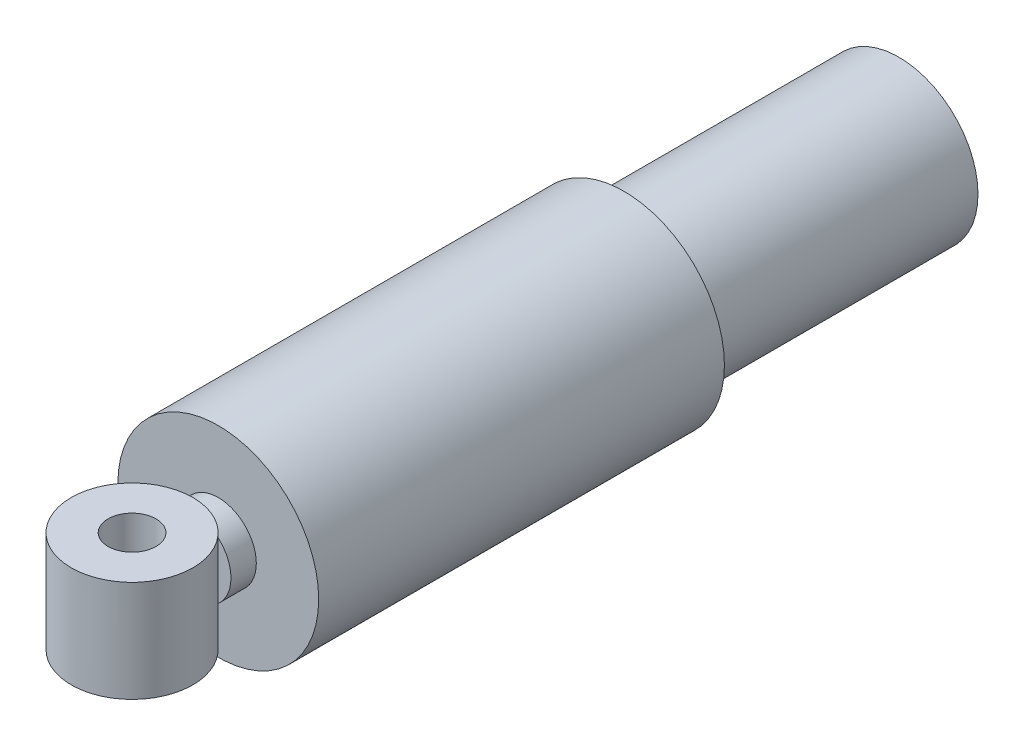
ISO-10303-21;
HEADER;
FILE_DESCRIPTION(('STEP AP214'),'2;1');
FILE_NAME('part.step','',(''),(''),'','','');
FILE_SCHEMA(('AUTOMOTIVE_DESIGN { 1 0 10303 214 1 1 1 1 }'));
ENDSEC;
DATA;
#1=APPLICATION_CONTEXT('core data for automotive mechanical design processes');
#2=APPLICATION_PROTOCOL_DEFINITION('international standard','automotive_design',2000,#1);
#3=PRODUCT_CONTEXT('',#1,'mechanical');
#4=PRODUCT('Part','Part','',(#3));
#5=PRODUCT_RELATED_PRODUCT_CATEGORY('part','',(#4));
#6=PRODUCT_DEFINITION_FORMATION('','',#4);
#7=PRODUCT_DEFINITION_CONTEXT('part definition',#1,'design');
#8=PRODUCT_DEFINITION('design','',#6,#7);
#9=PRODUCT_DEFINITION_SHAPE('','',#8);
#10=(LENGTH_UNIT() NAMED_UNIT(*) SI_UNIT(.MILLI.,.METRE.));
#11=(NAMED_UNIT(*) PLANE_ANGLE_UNIT() SI_UNIT($,.RADIAN.));
#12=(NAMED_UNIT(*) SI_UNIT($,.STERADIAN.) SOLID_ANGLE_UNIT());
#13=UNCERTAINTY_MEASURE_WITH_UNIT(LENGTH_MEASURE(1.E-05),#10,'distance_accuracy_value','');
#14=(GEOMETRIC_REPRESENTATION_CONTEXT(3) GLOBAL_UNCERTAINTY_ASSIGNED_CONTEXT((#13)) GLOBAL_UNIT_ASSIGNED_CONTEXT((#10,
#11,#12)) REPRESENTATION_CONTEXT('',''));
#15=CARTESIAN_POINT('',(0.,0.,0.));
#16=DIRECTION('',(0.,0.,1.));
#17=DIRECTION('',(1.,0.,0.));
#18=AXIS2_PLACEMENT_3D('',#15,#16,#17);
#19=CARTESIAN_POINT('',(0.,12.7,192.024));
#20=DIRECTION('',(0.,-1.,0.));
#21=DIRECTION('',(0.,0.,-1.));
#22=AXIS2_PLACEMENT_3D('',#19,#20,#21);
#23=CYLINDRICAL_SURFACE('',#22,15.24);
#24=CARTESIAN_POINT('',(0.,12.7,192.024));
#25=DIRECTION('',(0.,1.,0.));
#26=DIRECTION('',(0.,0.,1.));
#27=AXIS2_PLACEMENT_3D('',#24,#25,#26);
#28=CIRCLE('',#27,15.24);
#29=CARTESIAN_POINT('',(0.,12.7,207.264));
#30=VERTEX_POINT('',#29);
#31=EDGE_CURVE('E11',#30,#30,#28,.T.);
#32=ORIENTED_EDGE('',*,*,#31,.F.);
#33=EDGE_LOOP('',(#32));
#34=FACE_BOUND('',#33,.T.);
#35=CARTESIAN_POINT('',(0.,-12.7,192.024));
#36=DIRECTION('',(0.,-1.,0.));
#37=DIRECTION('',(0.,0.,-1.));
#38=AXIS2_PLACEMENT_3D('',#35,#36,#37);
#39=CIRCLE('',#38,15.24);
#40=CARTESIAN_POINT('',(0.,-12.7,176.784));
#41=VERTEX_POINT('',#40);
#42=EDGE_CURVE('E58',#41,#41,#39,.T.);
#43=ORIENTED_EDGE('',*,*,#42,.F.);
#44=EDGE_LOOP('',(#43));
#45=FACE_BOUND('',#44,.T.);
#46=ADVANCED_FACE('F51',(#34,#45),#23,.T.);
#47=CARTESIAN_POINT('',(0.,12.7,0.));
#48=DIRECTION('',(0.,1.,0.));
#49=DIRECTION('',(0.,0.,1.));
#50=AXIS2_PLACEMENT_3D('',#47,#48,#49);
#51=PLANE('',#50);
#52=CARTESIAN_POINT('',(0.,12.7,192.024));
#53=DIRECTION('',(0.,1.,0.));
#54=DIRECTION('',(0.,0.,1.));
#55=AXIS2_PLACEMENT_3D('',#52,#53,#54);
#56=CIRCLE('',#55,6.00074999999998);
#57=CARTESIAN_POINT('',(0.,12.7,198.02475));
#58=VERTEX_POINT('',#57);
#59=EDGE_CURVE('E64',#58,#58,#56,.T.);
#60=ORIENTED_EDGE('',*,*,#59,.F.);
#61=EDGE_LOOP('',(#60));
#62=FACE_BOUND('',#61,.T.);
#63=ORIENTED_EDGE('',*,*,#31,.T.);
#64=EDGE_LOOP('',(#63));
#65=FACE_BOUND('',#64,.T.);
#66=ADVANCED_FACE('F76',(#62,#65),#51,.T.);
#67=CARTESIAN_POINT('',(0.,-12.7,192.024));
#68=DIRECTION('',(0.,-1.,0.));
#69=DIRECTION('',(0.,0.,-1.));
#70=AXIS2_PLACEMENT_3D('',#67,#68,#69);
#71=PLANE('',#70);
#72=CARTESIAN_POINT('',(0.,-12.7,192.024));
#73=DIRECTION('',(0.,-1.,0.));
#74=DIRECTION('',(0.,0.,-1.));
#75=AXIS2_PLACEMENT_3D('',#72,#73,#74);
#76=CIRCLE('',#75,6.00074999999998);
#77=CARTESIAN_POINT('',(0.,-12.7,186.02325));
#78=VERTEX_POINT('',#77);
#79=EDGE_CURVE('E54',#78,#78,#76,.T.);
#80=ORIENTED_EDGE('',*,*,#79,.F.);
#81=EDGE_LOOP('',(#80));
#82=FACE_BOUND('',#81,.T.);
#83=ORIENTED_EDGE('',*,*,#42,.T.);
#84=EDGE_LOOP('',(#83));
#85=FACE_BOUND('',#84,.T.);
#86=ADVANCED_FACE('F73',(#82,#85),#71,.T.);
#87=CARTESIAN_POINT('',(0.,-25.146,192.024));
#88=DIRECTION('',(0.,1.,0.));
#89=DIRECTION('',(0.,0.,1.));
#90=AXIS2_PLACEMENT_3D('',#87,#88,#89);
#91=CYLINDRICAL_SURFACE('',#90,6.00074999999998);
#92=ORIENTED_EDGE('',*,*,#79,.T.);
#93=EDGE_LOOP('',(#92));
#94=FACE_BOUND('',#93,.T.);
#95=ORIENTED_EDGE('',*,*,#59,.T.);
#96=EDGE_LOOP('',(#95));
#97=FACE_BOUND('',#96,.T.);
#98=ADVANCED_FACE('F71',(#94,#97),#91,.F.);
#99=CLOSED_SHELL('',(#46,#66,#86,#98));
#100=MANIFOLD_SOLID_BREP('B2',#99);
#101=CARTESIAN_POINT('',(0.,0.,68.834));
#102=DIRECTION('',(0.,0.,-1.));
#103=DIRECTION('',(-1.,0.,0.));
#104=AXIS2_PLACEMENT_3D('',#101,#102,#103);
#105=CYLINDRICAL_SURFACE('',#104,19.812);
#106=CARTESIAN_POINT('',(0.,0.,68.834));
#107=DIRECTION('',(0.,0.,1.));
#108=DIRECTION('',(1.,0.,0.));
#109=AXIS2_PLACEMENT_3D('',#106,#107,#108);
#110=CIRCLE('',#109,19.812);
#111=CARTESIAN_POINT('',(19.812,0.,68.834));
#112=VERTEX_POINT('',#111);
#113=EDGE_CURVE('E132',#112,#112,#110,.T.);
#114=ORIENTED_EDGE('',*,*,#113,.F.);
#115=EDGE_LOOP('',(#114));
#116=FACE_BOUND('',#115,.T.);
#117=CARTESIAN_POINT('',(0.,0.,0.));
#118=DIRECTION('',(0.,0.,1.));
#119=DIRECTION('',(1.,0.,0.));
#120=AXIS2_PLACEMENT_3D('',#117,#118,#119);
#121=CIRCLE('',#120,19.812);
#122=CARTESIAN_POINT('',(19.812,0.,0.));
#123=VERTEX_POINT('',#122);
#124=EDGE_CURVE('E127',#123,#123,#121,.T.);
#125=ORIENTED_EDGE('',*,*,#124,.T.);
#126=EDGE_LOOP('',(#125));
#127=FACE_BOUND('',#126,.T.);
#128=ADVANCED_FACE('F124',(#116,#127),#105,.T.);
#129=CARTESIAN_POINT('',(0.,0.,0.));
#130=DIRECTION('',(0.,0.,1.));
#131=DIRECTION('',(1.,0.,0.));
#132=AXIS2_PLACEMENT_3D('',#129,#130,#131);
#133=PLANE('',#132);
#134=ORIENTED_EDGE('',*,*,#124,.F.);
#135=EDGE_LOOP('',(#134));
#136=FACE_BOUND('',#135,.T.);
#137=ADVANCED_FACE('F170',(#136),#133,.F.);
#138=CARTESIAN_POINT('',(0.,0.,170.434));
#139=DIRECTION('',(0.,0.,-1.));
#140=DIRECTION('',(-1.,0.,0.));
#141=AXIS2_PLACEMENT_3D('',#138,#139,#140);
#142=CYLINDRICAL_SURFACE('',#141,25.146);
#143=CARTESIAN_POINT('',(0.,0.,170.434));
#144=DIRECTION('',(0.,0.,1.));
#145=DIRECTION('',(1.,0.,0.));
#146=AXIS2_PLACEMENT_3D('',#143,#144,#145);
#147=CIRCLE('',#146,25.146);
#148=CARTESIAN_POINT('',(25.146,0.,170.434));
#149=VERTEX_POINT('',#148);
#150=EDGE_CURVE('E141',#149,#149,#147,.T.);
#151=ORIENTED_EDGE('',*,*,#150,.F.);
#152=EDGE_LOOP('',(#151));
#153=FACE_BOUND('',#152,.T.);
#154=CARTESIAN_POINT('',(0.,0.,68.834));
#155=DIRECTION('',(0.,0.,1.));
#156=DIRECTION('',(1.,0.,0.));
#157=AXIS2_PLACEMENT_3D('',#154,#155,#156);
#158=CIRCLE('',#157,25.146);
#159=CARTESIAN_POINT('',(25.146,0.,68.834));
#160=VERTEX_POINT('',#159);
#161=EDGE_CURVE('E145',#160,#160,#158,.T.);
#162=ORIENTED_EDGE('',*,*,#161,.T.);
#163=EDGE_LOOP('',(#162));
#164=FACE_BOUND('',#163,.T.);
#165=ADVANCED_FACE('F175',(#153,#164),#142,.T.);
#166=CARTESIAN_POINT('',(0.,0.,170.434));
#167=DIRECTION('',(0.,0.,1.));
#168=DIRECTION('',(1.,0.,0.));
#169=AXIS2_PLACEMENT_3D('',#166,#167,#168);
#170=PLANE('',#169);
#171=CARTESIAN_POINT('',(0.,0.,170.434));
#172=DIRECTION('',(0.,0.,1.));
#173=DIRECTION('',(1.,0.,0.));
#174=AXIS2_PLACEMENT_3D('',#171,#172,#173);
#175=CIRCLE('',#174,9.525);
#176=CARTESIAN_POINT('',(9.525,0.,170.434));
#177=VERTEX_POINT('',#176);
#178=EDGE_CURVE('E50',#177,#177,#175,.T.);
#179=ORIENTED_EDGE('',*,*,#178,.F.);
#180=EDGE_LOOP('',(#179));
#181=FACE_BOUND('',#180,.T.);
#182=ORIENTED_EDGE('',*,*,#150,.T.);
#183=EDGE_LOOP('',(#182));
#184=FACE_BOUND('',#183,.T.);
#185=ADVANCED_FACE('F165',(#181,#184),#170,.T.);
#186=CARTESIAN_POINT('',(0.,0.,68.834));
#187=DIRECTION('',(0.,0.,1.));
#188=DIRECTION('',(1.,0.,0.));
#189=AXIS2_PLACEMENT_3D('',#186,#187,#188);
#190=PLANE('',#189);
#191=ORIENTED_EDGE('',*,*,#113,.T.);
#192=EDGE_LOOP('',(#191));
#193=FACE_BOUND('',#192,.T.);
#194=ORIENTED_EDGE('',*,*,#161,.F.);
#195=EDGE_LOOP('',(#194));
#196=FACE_BOUND('',#195,.T.);
#197=ADVANCED_FACE('F158',(#193,#196),#190,.F.);
#198=CARTESIAN_POINT('',(0.,0.,176.784));
#199=DIRECTION('',(0.,0.,-1.));
#200=DIRECTION('',(-1.,0.,0.));
#201=AXIS2_PLACEMENT_3D('',#198,#199,#200);
#202=CYLINDRICAL_SURFACE('',#201,9.525);
#203=CARTESIAN_POINT('',(0.,0.,176.784));
#204=DIRECTION('',(0.,0.,1.));
#205=DIRECTION('',(1.,0.,0.));
#206=AXIS2_PLACEMENT_3D('',#203,#204,#205);
#207=CIRCLE('',#206,9.525);
#208=CARTESIAN_POINT('',(9.525,0.,176.784));
#209=VERTEX_POINT('',#208);
#210=EDGE_CURVE('E140',#209,#209,#207,.T.);
#211=ORIENTED_EDGE('',*,*,#210,.F.);
#212=EDGE_LOOP('',(#211));
#213=FACE_BOUND('',#212,.T.);
#214=ORIENTED_EDGE('',*,*,#178,.T.);
#215=EDGE_LOOP('',(#214));
#216=FACE_BOUND('',#215,.T.);
#217=ADVANCED_FACE('F156',(#213,#216),#202,.T.);
#218=CARTESIAN_POINT('',(0.,0.,176.784));
#219=DIRECTION('',(0.,0.,1.));
#220=DIRECTION('',(1.,0.,0.));
#221=AXIS2_PLACEMENT_3D('',#218,#219,#220);
#222=PLANE('',#221);
#223=ORIENTED_EDGE('',*,*,#210,.T.);
#224=EDGE_LOOP('',(#223));
#225=FACE_BOUND('',#224,.T.);
#226=ADVANCED_FACE('F154',(#225),#222,.T.);
#227=CLOSED_SHELL('',(#128,#137,#165,#185,#197,#217,#226));
#228=MANIFOLD_SOLID_BREP('B6',#227);
#229=ADVANCED_BREP_SHAPE_REPRESENTATION('',(#18,#100,#228),#14);
#230=SHAPE_DEFINITION_REPRESENTATION(#9,#229);
ENDSEC;
END-ISO-10303-21;
